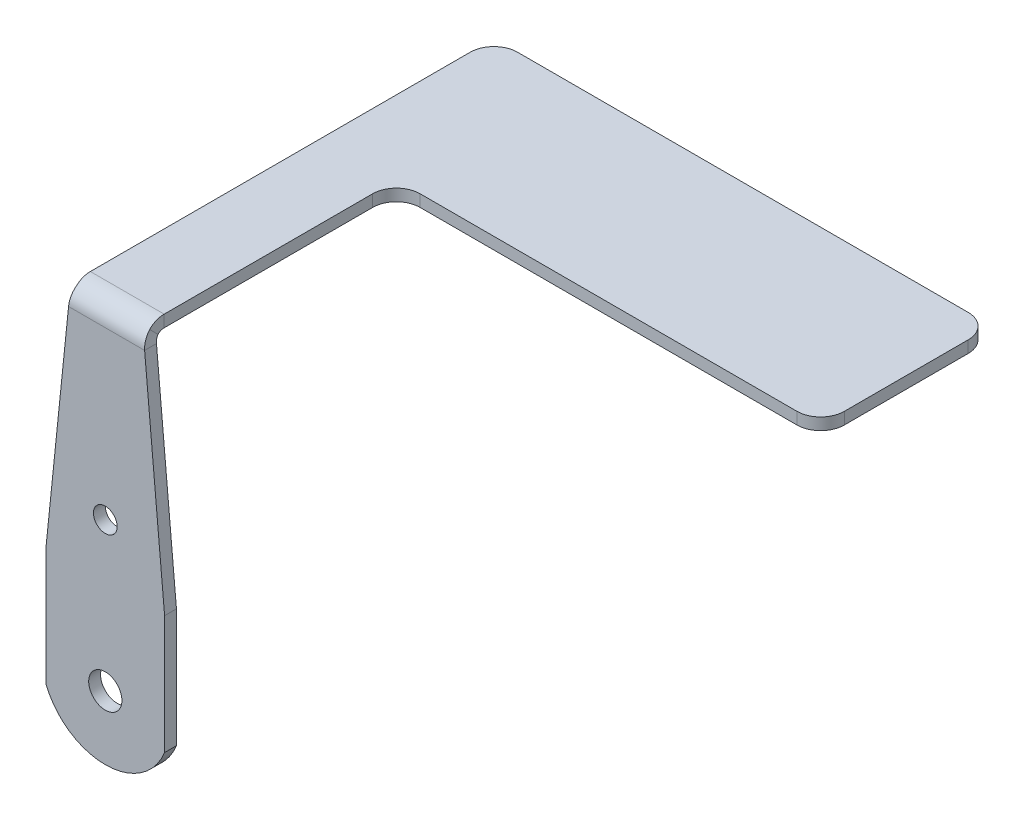
ISO-10303-21;
HEADER;
FILE_DESCRIPTION(('STEP AP214'),'2;1');
FILE_NAME('part.step','',(''),(''),'','','');
FILE_SCHEMA(('AUTOMOTIVE_DESIGN { 1 0 10303 214 1 1 1 1 }'));
ENDSEC;
DATA;
#1=APPLICATION_CONTEXT('core data for automotive mechanical design processes');
#2=APPLICATION_PROTOCOL_DEFINITION('international standard','automotive_design',2000,#1);
#3=PRODUCT_CONTEXT('',#1,'mechanical');
#4=PRODUCT('Part','Part','',(#3));
#5=PRODUCT_RELATED_PRODUCT_CATEGORY('part','',(#4));
#6=PRODUCT_DEFINITION_FORMATION('','',#4);
#7=PRODUCT_DEFINITION_CONTEXT('part definition',#1,'design');
#8=PRODUCT_DEFINITION('design','',#6,#7);
#9=PRODUCT_DEFINITION_SHAPE('','',#8);
#10=(LENGTH_UNIT() NAMED_UNIT(*) SI_UNIT(.MILLI.,.METRE.));
#11=(NAMED_UNIT(*) PLANE_ANGLE_UNIT() SI_UNIT($,.RADIAN.));
#12=(NAMED_UNIT(*) SI_UNIT($,.STERADIAN.) SOLID_ANGLE_UNIT());
#13=UNCERTAINTY_MEASURE_WITH_UNIT(LENGTH_MEASURE(1.E-05),#10,'distance_accuracy_value','');
#14=(GEOMETRIC_REPRESENTATION_CONTEXT(3) GLOBAL_UNCERTAINTY_ASSIGNED_CONTEXT((#13)) GLOBAL_UNIT_ASSIGNED_CONTEXT((#10,
#11,#12)) REPRESENTATION_CONTEXT('',''));
#15=CARTESIAN_POINT('',(0.,0.,0.));
#16=DIRECTION('',(0.,0.,1.));
#17=DIRECTION('',(1.,0.,0.));
#18=AXIS2_PLACEMENT_3D('',#15,#16,#17);
#19=CARTESIAN_POINT('',(42.1509861979315,13.5038150311188,-33.7652042118766));
#20=DIRECTION('',(-1.,0.,0.));
#21=DIRECTION('',(0.,1.,0.));
#22=AXIS2_PLACEMENT_3D('',#19,#20,#21);
#23=PLANE('',#22);
#24=DIRECTION('',(0.,0.,1.));
#25=VECTOR('',#24,1.);
#26=CARTESIAN_POINT('',(42.1509861979315,13.5038150311188,-33.7652042118766));
#27=LINE('',#26,#25);
#28=CARTESIAN_POINT('',(42.1509861979315,13.5038150311188,-33.7652042118766));
#29=VERTEX_POINT('',#28);
#30=CARTESIAN_POINT('',(42.1509861979315,13.5038150311189,-1.7366));
#31=VERTEX_POINT('',#30);
#32=EDGE_CURVE('E164',#29,#31,#27,.T.);
#33=ORIENTED_EDGE('',*,*,#32,.T.);
#34=DIRECTION('',(0.,1.,0.));
#35=VECTOR('',#34,1.);
#36=CARTESIAN_POINT('',(42.1509861979315,13.5038150311189,-1.7366));
#37=LINE('',#36,#35);
#38=CARTESIAN_POINT('',(42.1509861979315,14.5038150311189,-1.73660000000001));
#39=VERTEX_POINT('',#38);
#40=EDGE_CURVE('E12',#31,#39,#37,.T.);
#41=ORIENTED_EDGE('',*,*,#40,.T.);
#42=DIRECTION('',(0.,0.,1.));
#43=VECTOR('',#42,1.);
#44=CARTESIAN_POINT('',(42.1509861979315,14.5038150311188,-33.7652042118766));
#45=LINE('',#44,#43);
#46=CARTESIAN_POINT('',(42.1509861979315,14.5038150311188,-33.7652042118766));
#47=VERTEX_POINT('',#46);
#48=EDGE_CURVE('E191',#47,#39,#45,.T.);
#49=ORIENTED_EDGE('',*,*,#48,.F.);
#50=DIRECTION('',(0.,1.,0.));
#51=VECTOR('',#50,1.);
#52=CARTESIAN_POINT('',(42.1509861979315,13.5038150311188,-33.7652042118766));
#53=LINE('',#52,#51);
#54=EDGE_CURVE('E152',#29,#47,#53,.T.);
#55=ORIENTED_EDGE('',*,*,#54,.F.);
#56=EDGE_LOOP('',(#33,#41,#49,#55));
#57=FACE_BOUND('',#56,.T.);
#58=ADVANCED_FACE('F56',(#57),#23,.T.);
#59=CARTESIAN_POINT('',(48.375969085374,13.5038150311188,-19.3196620303949));
#60=DIRECTION('',(1.,0.,0.));
#61=DIRECTION('',(0.,-1.,0.));
#62=AXIS2_PLACEMENT_3D('',#59,#60,#61);
#63=PLANE('',#62);
#64=DIRECTION('',(0.,0.,-1.));
#65=VECTOR('',#64,1.);
#66=CARTESIAN_POINT('',(48.375969085374,14.5038150311188,-19.3196620303949));
#67=LINE('',#66,#65);
#68=CARTESIAN_POINT('',(48.375969085374,14.5038150311189,-1.73660000000001));
#69=VERTEX_POINT('',#68);
#70=CARTESIAN_POINT('',(48.375969085374,14.5038150311188,-19.3196620303949));
#71=VERTEX_POINT('',#70);
#72=EDGE_CURVE('E115',#69,#71,#67,.T.);
#73=ORIENTED_EDGE('',*,*,#72,.F.);
#74=DIRECTION('',(0.,-1.,0.));
#75=VECTOR('',#74,1.);
#76=CARTESIAN_POINT('',(48.375969085374,13.5038150311189,-1.7366));
#77=LINE('',#76,#75);
#78=CARTESIAN_POINT('',(48.375969085374,13.5038150311189,-1.7366));
#79=VERTEX_POINT('',#78);
#80=EDGE_CURVE('E205',#69,#79,#77,.T.);
#81=ORIENTED_EDGE('',*,*,#80,.T.);
#82=DIRECTION('',(0.,0.,-1.));
#83=VECTOR('',#82,1.);
#84=CARTESIAN_POINT('',(48.375969085374,13.5038150311188,-19.3196620303949));
#85=LINE('',#84,#83);
#86=CARTESIAN_POINT('',(48.375969085374,13.5038150311188,-19.3196620303949));
#87=VERTEX_POINT('',#86);
#88=EDGE_CURVE('E59',#79,#87,#85,.T.);
#89=ORIENTED_EDGE('',*,*,#88,.T.);
#90=DIRECTION('',(0.,1.,0.));
#91=VECTOR('',#90,1.);
#92=CARTESIAN_POINT('',(48.375969085374,13.5038150311188,-19.3196620303949));
#93=LINE('',#92,#91);
#94=EDGE_CURVE('E192',#87,#71,#93,.T.);
#95=ORIENTED_EDGE('',*,*,#94,.T.);
#96=EDGE_LOOP('',(#73,#81,#89,#95));
#97=FACE_BOUND('',#96,.T.);
#98=ADVANCED_FACE('F240',(#97),#63,.T.);
#99=CARTESIAN_POINT('',(50.375969085374,13.5038150311188,-19.3196620303949));
#100=DIRECTION('',(0.,-1.,0.));
#101=DIRECTION('',(-1.,0.,0.));
#102=AXIS2_PLACEMENT_3D('',#99,#100,#101);
#103=PLANE('',#102);
#104=ORIENTED_EDGE('',*,*,#88,.F.);
#105=DIRECTION('',(-1.,0.,0.));
#106=VECTOR('',#105,1.);
#107=CARTESIAN_POINT('',(50.375969085374,13.5038150311189,-1.7366));
#108=LINE('',#107,#106);
#109=EDGE_CURVE('E194',#79,#31,#108,.T.);
#110=ORIENTED_EDGE('',*,*,#109,.T.);
#111=ORIENTED_EDGE('',*,*,#32,.F.);
#112=CARTESIAN_POINT('',(44.1509861979315,13.5038150311188,-33.7652042118766));
#113=DIRECTION('',(0.,1.,0.));
#114=DIRECTION('',(-1.,0.,0.));
#115=AXIS2_PLACEMENT_3D('',#112,#113,#114);
#116=CIRCLE('',#115,2.);
#117=CARTESIAN_POINT('',(44.1509861979315,13.5038150311188,-35.7652042118766));
#118=VERTEX_POINT('',#117);
#119=EDGE_CURVE('E145',#118,#29,#116,.T.);
#120=ORIENTED_EDGE('',*,*,#119,.F.);
#121=DIRECTION('',(-1.,0.,0.));
#122=VECTOR('',#121,1.);
#123=CARTESIAN_POINT('',(44.1509861979315,13.5038150311188,-35.7652042118766));
#124=LINE('',#123,#122);
#125=CARTESIAN_POINT('',(82.1509861979315,13.5038150311187,-35.7652042118766));
#126=VERTEX_POINT('',#125);
#127=EDGE_CURVE('E160',#126,#118,#124,.T.);
#128=ORIENTED_EDGE('',*,*,#127,.F.);
#129=CARTESIAN_POINT('',(82.1509861979315,13.5038150311187,-33.7652042118766));
#130=DIRECTION('',(0.,1.,0.));
#131=DIRECTION('',(-1.,0.,0.));
#132=AXIS2_PLACEMENT_3D('',#129,#130,#131);
#133=CIRCLE('',#132,2.);
#134=CARTESIAN_POINT('',(84.1509861979315,13.5038150311187,-33.7652042118766));
#135=VERTEX_POINT('',#134);
#136=EDGE_CURVE('E167',#135,#126,#133,.T.);
#137=ORIENTED_EDGE('',*,*,#136,.F.);
#138=DIRECTION('',(0.,0.,-1.));
#139=VECTOR('',#138,1.);
#140=CARTESIAN_POINT('',(84.1509861979315,13.5038150311187,-33.7652042118766));
#141=LINE('',#140,#139);
#142=CARTESIAN_POINT('',(84.1509861979315,13.5038150311188,-23.3196620303949));
#143=VERTEX_POINT('',#142);
#144=EDGE_CURVE('E169',#143,#135,#141,.T.);
#145=ORIENTED_EDGE('',*,*,#144,.F.);
#146=CARTESIAN_POINT('',(82.1509861979315,13.5038150311188,-23.3196620303949));
#147=DIRECTION('',(0.,1.,0.));
#148=DIRECTION('',(1.,0.,0.));
#149=AXIS2_PLACEMENT_3D('',#146,#147,#148);
#150=CIRCLE('',#149,2.00000000000001);
#151=CARTESIAN_POINT('',(82.1509861979315,13.5038150311188,-21.3196620303949));
#152=VERTEX_POINT('',#151);
#153=EDGE_CURVE('E217',#152,#143,#150,.T.);
#154=ORIENTED_EDGE('',*,*,#153,.F.);
#155=DIRECTION('',(1.,0.,0.));
#156=VECTOR('',#155,1.);
#157=CARTESIAN_POINT('',(82.1509861979315,13.5038150311188,-21.3196620303949));
#158=LINE('',#157,#156);
#159=CARTESIAN_POINT('',(50.375969085374,13.5038150311188,-21.3196620303949));
#160=VERTEX_POINT('',#159);
#161=EDGE_CURVE('E213',#160,#152,#158,.T.);
#162=ORIENTED_EDGE('',*,*,#161,.F.);
#163=CARTESIAN_POINT('',(50.375969085374,13.5038150311188,-19.3196620303949));
#164=DIRECTION('',(0.,-1.,0.));
#165=DIRECTION('',(-1.,0.,0.));
#166=AXIS2_PLACEMENT_3D('',#163,#164,#165);
#167=CIRCLE('',#166,2.);
#168=EDGE_CURVE('E211',#87,#160,#167,.T.);
#169=ORIENTED_EDGE('',*,*,#168,.F.);
#170=EDGE_LOOP('',(#104,#110,#111,#120,#128,#137,#145,#154,#162,#169));
#171=FACE_BOUND('',#170,.T.);
#172=ADVANCED_FACE('F158',(#171),#103,.T.);
#173=CARTESIAN_POINT('',(50.375969085374,13.5038150311188,-19.3196620303949));
#174=DIRECTION('',(0.,1.,0.));
#175=DIRECTION('',(1.,0.,0.));
#176=AXIS2_PLACEMENT_3D('',#173,#174,#175);
#177=CYLINDRICAL_SURFACE('',#176,2.);
#178=CARTESIAN_POINT('',(50.375969085374,14.5038150311188,-19.3196620303949));
#179=DIRECTION('',(0.,-1.,0.));
#180=DIRECTION('',(-1.,0.,0.));
#181=AXIS2_PLACEMENT_3D('',#178,#179,#180);
#182=CIRCLE('',#181,2.);
#183=CARTESIAN_POINT('',(50.375969085374,14.5038150311188,-21.319662030395));
#184=VERTEX_POINT('',#183);
#185=EDGE_CURVE('E173',#71,#184,#182,.T.);
#186=ORIENTED_EDGE('',*,*,#185,.F.);
#187=ORIENTED_EDGE('',*,*,#94,.F.);
#188=ORIENTED_EDGE('',*,*,#168,.T.);
#189=DIRECTION('',(0.,1.,0.));
#190=VECTOR('',#189,1.);
#191=CARTESIAN_POINT('',(50.375969085374,13.5038150311188,-21.3196620303949));
#192=LINE('',#191,#190);
#193=EDGE_CURVE('E122',#160,#184,#192,.T.);
#194=ORIENTED_EDGE('',*,*,#193,.T.);
#195=EDGE_LOOP('',(#186,#187,#188,#194));
#196=FACE_BOUND('',#195,.T.);
#197=ADVANCED_FACE('F459',(#196),#177,.F.);
#198=CARTESIAN_POINT('',(44.1509861979315,13.5038150311188,-33.7652042118766));
#199=DIRECTION('',(0.,1.,0.));
#200=DIRECTION('',(1.,0.,0.));
#201=AXIS2_PLACEMENT_3D('',#198,#199,#200);
#202=CYLINDRICAL_SURFACE('',#201,2.);
#203=CARTESIAN_POINT('',(44.1509861979315,14.5038150311188,-33.7652042118766));
#204=DIRECTION('',(0.,1.,0.));
#205=DIRECTION('',(-1.,0.,0.));
#206=AXIS2_PLACEMENT_3D('',#203,#204,#205);
#207=CIRCLE('',#206,2.);
#208=CARTESIAN_POINT('',(44.1509861979315,14.5038150311188,-35.7652042118766));
#209=VERTEX_POINT('',#208);
#210=EDGE_CURVE('E147',#209,#47,#207,.T.);
#211=ORIENTED_EDGE('',*,*,#210,.F.);
#212=DIRECTION('',(0.,1.,0.));
#213=VECTOR('',#212,1.);
#214=CARTESIAN_POINT('',(44.1509861979315,13.5038150311188,-35.7652042118766));
#215=LINE('',#214,#213);
#216=EDGE_CURVE('E142',#118,#209,#215,.T.);
#217=ORIENTED_EDGE('',*,*,#216,.F.);
#218=ORIENTED_EDGE('',*,*,#119,.T.);
#219=ORIENTED_EDGE('',*,*,#54,.T.);
#220=EDGE_LOOP('',(#211,#217,#218,#219));
#221=FACE_BOUND('',#220,.T.);
#222=ADVANCED_FACE('F144',(#221),#202,.T.);
#223=CARTESIAN_POINT('',(44.1509861979315,13.5038150311188,-35.7652042118766));
#224=DIRECTION('',(0.,0.,-1.));
#225=DIRECTION('',(0.,1.,0.));
#226=AXIS2_PLACEMENT_3D('',#223,#224,#225);
#227=PLANE('',#226);
#228=DIRECTION('',(-1.,0.,0.));
#229=VECTOR('',#228,1.);
#230=CARTESIAN_POINT('',(44.1509861979315,14.5038150311188,-35.7652042118766));
#231=LINE('',#230,#229);
#232=CARTESIAN_POINT('',(82.1509861979315,14.5038150311187,-35.7652042118766));
#233=VERTEX_POINT('',#232);
#234=EDGE_CURVE('E188',#233,#209,#231,.T.);
#235=ORIENTED_EDGE('',*,*,#234,.F.);
#236=DIRECTION('',(0.,1.,0.));
#237=VECTOR('',#236,1.);
#238=CARTESIAN_POINT('',(82.1509861979315,13.5038150311187,-35.7652042118766));
#239=LINE('',#238,#237);
#240=EDGE_CURVE('E153',#126,#233,#239,.T.);
#241=ORIENTED_EDGE('',*,*,#240,.F.);
#242=ORIENTED_EDGE('',*,*,#127,.T.);
#243=ORIENTED_EDGE('',*,*,#216,.T.);
#244=EDGE_LOOP('',(#235,#241,#242,#243));
#245=FACE_BOUND('',#244,.T.);
#246=ADVANCED_FACE('F166',(#245),#227,.T.);
#247=CARTESIAN_POINT('',(82.1509861979315,13.5038150311187,-33.7652042118766));
#248=DIRECTION('',(0.,1.,0.));
#249=DIRECTION('',(1.,0.,0.));
#250=AXIS2_PLACEMENT_3D('',#247,#248,#249);
#251=CYLINDRICAL_SURFACE('',#250,2.);
#252=CARTESIAN_POINT('',(82.1509861979315,14.5038150311187,-33.7652042118766));
#253=DIRECTION('',(0.,1.,0.));
#254=DIRECTION('',(-1.,0.,0.));
#255=AXIS2_PLACEMENT_3D('',#252,#253,#254);
#256=CIRCLE('',#255,2.);
#257=CARTESIAN_POINT('',(84.1509861979315,14.5038150311187,-33.7652042118766));
#258=VERTEX_POINT('',#257);
#259=EDGE_CURVE('E185',#258,#233,#256,.T.);
#260=ORIENTED_EDGE('',*,*,#259,.F.);
#261=DIRECTION('',(0.,1.,0.));
#262=VECTOR('',#261,1.);
#263=CARTESIAN_POINT('',(84.1509861979315,13.5038150311187,-33.7652042118766));
#264=LINE('',#263,#262);
#265=EDGE_CURVE('E197',#135,#258,#264,.T.);
#266=ORIENTED_EDGE('',*,*,#265,.F.);
#267=ORIENTED_EDGE('',*,*,#136,.T.);
#268=ORIENTED_EDGE('',*,*,#240,.T.);
#269=EDGE_LOOP('',(#260,#266,#267,#268));
#270=FACE_BOUND('',#269,.T.);
#271=ADVANCED_FACE('F462',(#270),#251,.T.);
#272=CARTESIAN_POINT('',(84.1509861979315,13.5038150311187,-33.7652042118766));
#273=DIRECTION('',(1.,0.,0.));
#274=DIRECTION('',(0.,0.,-1.));
#275=AXIS2_PLACEMENT_3D('',#272,#273,#274);
#276=PLANE('',#275);
#277=DIRECTION('',(0.,0.,-1.));
#278=VECTOR('',#277,1.);
#279=CARTESIAN_POINT('',(84.1509861979315,14.5038150311187,-33.7652042118766));
#280=LINE('',#279,#278);
#281=CARTESIAN_POINT('',(84.1509861979315,14.5038150311188,-23.319662030395));
#282=VERTEX_POINT('',#281);
#283=EDGE_CURVE('E182',#282,#258,#280,.T.);
#284=ORIENTED_EDGE('',*,*,#283,.F.);
#285=DIRECTION('',(0.,1.,0.));
#286=VECTOR('',#285,1.);
#287=CARTESIAN_POINT('',(84.1509861979315,13.5038150311188,-23.3196620303949));
#288=LINE('',#287,#286);
#289=EDGE_CURVE('E199',#143,#282,#288,.T.);
#290=ORIENTED_EDGE('',*,*,#289,.F.);
#291=ORIENTED_EDGE('',*,*,#144,.T.);
#292=ORIENTED_EDGE('',*,*,#265,.T.);
#293=EDGE_LOOP('',(#284,#290,#291,#292));
#294=FACE_BOUND('',#293,.T.);
#295=ADVANCED_FACE('F228',(#294),#276,.T.);
#296=CARTESIAN_POINT('',(82.1509861979315,13.5038150311188,-23.3196620303949));
#297=DIRECTION('',(0.,1.,0.));
#298=DIRECTION('',(1.,0.,0.));
#299=AXIS2_PLACEMENT_3D('',#296,#297,#298);
#300=CYLINDRICAL_SURFACE('',#299,2.00000000000001);
#301=CARTESIAN_POINT('',(82.1509861979315,14.5038150311188,-23.319662030395));
#302=DIRECTION('',(0.,1.,0.));
#303=DIRECTION('',(1.,0.,0.));
#304=AXIS2_PLACEMENT_3D('',#301,#302,#303);
#305=CIRCLE('',#304,2.00000000000001);
#306=CARTESIAN_POINT('',(82.1509861979315,14.5038150311188,-21.3196620303949));
#307=VERTEX_POINT('',#306);
#308=EDGE_CURVE('E179',#307,#282,#305,.T.);
#309=ORIENTED_EDGE('',*,*,#308,.F.);
#310=DIRECTION('',(0.,1.,0.));
#311=VECTOR('',#310,1.);
#312=CARTESIAN_POINT('',(82.1509861979315,13.5038150311188,-21.3196620303949));
#313=LINE('',#312,#311);
#314=EDGE_CURVE('E201',#152,#307,#313,.T.);
#315=ORIENTED_EDGE('',*,*,#314,.F.);
#316=ORIENTED_EDGE('',*,*,#153,.T.);
#317=ORIENTED_EDGE('',*,*,#289,.T.);
#318=EDGE_LOOP('',(#309,#315,#316,#317));
#319=FACE_BOUND('',#318,.T.);
#320=ADVANCED_FACE('F233',(#319),#300,.T.);
#321=CARTESIAN_POINT('',(82.1509861979315,13.5038150311188,-21.3196620303949));
#322=DIRECTION('',(0.,0.,1.));
#323=DIRECTION('',(1.,0.,0.));
#324=AXIS2_PLACEMENT_3D('',#321,#322,#323);
#325=PLANE('',#324);
#326=DIRECTION('',(1.,0.,0.));
#327=VECTOR('',#326,1.);
#328=CARTESIAN_POINT('',(82.1509861979315,14.5038150311188,-21.319662030395));
#329=LINE('',#328,#327);
#330=EDGE_CURVE('E175',#184,#307,#329,.T.);
#331=ORIENTED_EDGE('',*,*,#330,.F.);
#332=ORIENTED_EDGE('',*,*,#193,.F.);
#333=ORIENTED_EDGE('',*,*,#161,.T.);
#334=ORIENTED_EDGE('',*,*,#314,.T.);
#335=EDGE_LOOP('',(#331,#332,#333,#334));
#336=FACE_BOUND('',#335,.T.);
#337=ADVANCED_FACE('F234',(#336),#325,.T.);
#338=CARTESIAN_POINT('',(50.375969085374,14.5038150311188,-19.3196620303949));
#339=DIRECTION('',(0.,-1.,0.));
#340=DIRECTION('',(-1.,0.,0.));
#341=AXIS2_PLACEMENT_3D('',#338,#339,#340);
#342=PLANE('',#341);
#343=DIRECTION('',(-1.,0.,0.));
#344=VECTOR('',#343,1.);
#345=CARTESIAN_POINT('',(50.375969085374,14.5038150311189,-1.73660000000001));
#346=LINE('',#345,#344);
#347=EDGE_CURVE('E64',#69,#39,#346,.T.);
#348=ORIENTED_EDGE('',*,*,#347,.F.);
#349=ORIENTED_EDGE('',*,*,#72,.T.);
#350=ORIENTED_EDGE('',*,*,#185,.T.);
#351=ORIENTED_EDGE('',*,*,#330,.T.);
#352=ORIENTED_EDGE('',*,*,#308,.T.);
#353=ORIENTED_EDGE('',*,*,#283,.T.);
#354=ORIENTED_EDGE('',*,*,#259,.T.);
#355=ORIENTED_EDGE('',*,*,#234,.T.);
#356=ORIENTED_EDGE('',*,*,#210,.T.);
#357=ORIENTED_EDGE('',*,*,#48,.T.);
#358=EDGE_LOOP('',(#348,#349,#350,#351,#352,#353,#354,#355,#356,#357));
#359=FACE_BOUND('',#358,.T.);
#360=ADVANCED_FACE('F380',(#359),#342,.F.);
#361=CARTESIAN_POINT('',(45.1482089892891,-13.7615616000238,-1.));
#362=DIRECTION('',(0.,0.,1.));
#363=DIRECTION('',(1.,0.,0.));
#364=AXIS2_PLACEMENT_3D('',#361,#362,#363);
#365=CYLINDRICAL_SURFACE('',#364,1.3999999999584);
#366=CARTESIAN_POINT('',(45.1482089892891,-13.7615616000238,-1.));
#367=DIRECTION('',(0.,0.,1.));
#368=DIRECTION('',(1.,0.,0.));
#369=AXIS2_PLACEMENT_3D('',#366,#367,#368);
#370=CIRCLE('',#369,1.3999999999584);
#371=CARTESIAN_POINT('',(46.5482089892475,-13.7615616000238,-1.));
#372=VERTEX_POINT('',#371);
#373=EDGE_CURVE('E528',#372,#372,#370,.T.);
#374=ORIENTED_EDGE('',*,*,#373,.F.);
#375=EDGE_LOOP('',(#374));
#376=FACE_BOUND('',#375,.T.);
#377=CARTESIAN_POINT('',(45.1482089892891,-13.7615616000238,0.));
#378=DIRECTION('',(0.,0.,1.));
#379=DIRECTION('',(1.,0.,0.));
#380=AXIS2_PLACEMENT_3D('',#377,#378,#379);
#381=CIRCLE('',#380,1.3999999999584);
#382=CARTESIAN_POINT('',(46.5482089892475,-13.7615616000238,0.));
#383=VERTEX_POINT('',#382);
#384=EDGE_CURVE('E533',#383,#383,#381,.T.);
#385=ORIENTED_EDGE('',*,*,#384,.T.);
#386=EDGE_LOOP('',(#385));
#387=FACE_BOUND('',#386,.T.);
#388=ADVANCED_FACE('F376',(#376,#387),#365,.F.);
#389=CARTESIAN_POINT('',(45.1482089892891,-1.26156160002384,-1.));
#390=DIRECTION('',(0.,0.,1.));
#391=DIRECTION('',(1.,0.,0.));
#392=AXIS2_PLACEMENT_3D('',#389,#390,#391);
#393=CYLINDRICAL_SURFACE('',#392,0.9999999999584);
#394=CARTESIAN_POINT('',(45.1482089892891,-1.26156160002384,-1.));
#395=DIRECTION('',(0.,0.,1.));
#396=DIRECTION('',(1.,0.,0.));
#397=AXIS2_PLACEMENT_3D('',#394,#395,#396);
#398=CIRCLE('',#397,0.9999999999584);
#399=CARTESIAN_POINT('',(46.1482089892475,-1.26156160002384,-1.));
#400=VERTEX_POINT('',#399);
#401=EDGE_CURVE('E815',#400,#400,#398,.T.);
#402=ORIENTED_EDGE('',*,*,#401,.F.);
#403=EDGE_LOOP('',(#402));
#404=FACE_BOUND('',#403,.T.);
#405=CARTESIAN_POINT('',(45.1482089892891,-1.26156160002384,0.));
#406=DIRECTION('',(0.,0.,1.));
#407=DIRECTION('',(1.,0.,0.));
#408=AXIS2_PLACEMENT_3D('',#405,#406,#407);
#409=CIRCLE('',#408,0.9999999999584);
#410=CARTESIAN_POINT('',(46.1482089892475,-1.26156160002384,0.));
#411=VERTEX_POINT('',#410);
#412=EDGE_CURVE('E799',#411,#411,#409,.T.);
#413=ORIENTED_EDGE('',*,*,#412,.T.);
#414=EDGE_LOOP('',(#413));
#415=FACE_BOUND('',#414,.T.);
#416=ADVANCED_FACE('F379',(#404,#415),#393,.F.);
#417=CARTESIAN_POINT('',(40.1482089892891,-5.76156160002383,-1.));
#418=DIRECTION('',(-1.,0.,0.));
#419=DIRECTION('',(0.,0.,1.));
#420=AXIS2_PLACEMENT_3D('',#417,#418,#419);
#421=PLANE('',#420);
#422=DIRECTION('',(0.,-1.,0.));
#423=VECTOR('',#422,1.);
#424=CARTESIAN_POINT('',(40.1482089892891,-5.76156160002383,0.));
#425=LINE('',#424,#423);
#426=CARTESIAN_POINT('',(40.1482089892891,-5.76156160002383,0.));
#427=VERTEX_POINT('',#426);
#428=CARTESIAN_POINT('',(40.1482089892891,-15.7615616000238,0.));
#429=VERTEX_POINT('',#428);
#430=EDGE_CURVE('E434',#427,#429,#425,.T.);
#431=ORIENTED_EDGE('',*,*,#430,.F.);
#432=DIRECTION('',(0.,0.,1.));
#433=VECTOR('',#432,1.);
#434=CARTESIAN_POINT('',(40.1482089892891,-5.76156160002383,-1.));
#435=LINE('',#434,#433);
#436=CARTESIAN_POINT('',(40.1482089892891,-5.76156160002383,-1.));
#437=VERTEX_POINT('',#436);
#438=EDGE_CURVE('E176',#437,#427,#435,.T.);
#439=ORIENTED_EDGE('',*,*,#438,.F.);
#440=DIRECTION('',(0.,-1.,0.));
#441=VECTOR('',#440,1.);
#442=CARTESIAN_POINT('',(40.1482089892891,-5.76156160002383,-1.));
#443=LINE('',#442,#441);
#444=CARTESIAN_POINT('',(40.1482089892891,-15.7615616000238,-1.));
#445=VERTEX_POINT('',#444);
#446=EDGE_CURVE('E828',#437,#445,#443,.T.);
#447=ORIENTED_EDGE('',*,*,#446,.T.);
#448=DIRECTION('',(0.,0.,1.));
#449=VECTOR('',#448,1.);
#450=CARTESIAN_POINT('',(40.1482089892891,-15.7615616000238,-1.));
#451=LINE('',#450,#449);
#452=EDGE_CURVE('E826',#445,#429,#451,.T.);
#453=ORIENTED_EDGE('',*,*,#452,.T.);
#454=EDGE_LOOP('',(#431,#439,#447,#453));
#455=FACE_BOUND('',#454,.T.);
#456=ADVANCED_FACE('F384',(#455),#421,.T.);
#457=CARTESIAN_POINT('',(45.1482089892891,-13.7615616000238,-1.));
#458=DIRECTION('',(0.,0.,1.));
#459=DIRECTION('',(1.,0.,0.));
#460=AXIS2_PLACEMENT_3D('',#457,#458,#459);
#461=CYLINDRICAL_SURFACE('',#460,5.3851648071345);
#462=CARTESIAN_POINT('',(45.1482089892891,-13.7615616000238,0.));
#463=DIRECTION('',(0.,0.,1.));
#464=DIRECTION('',(1.,0.,0.));
#465=AXIS2_PLACEMENT_3D('',#462,#463,#464);
#466=CIRCLE('',#465,5.3851648071345);
#467=CARTESIAN_POINT('',(50.1482089892891,-15.7615616000238,0.));
#468=VERTEX_POINT('',#467);
#469=EDGE_CURVE('E809',#429,#468,#466,.T.);
#470=ORIENTED_EDGE('',*,*,#469,.F.);
#471=ORIENTED_EDGE('',*,*,#452,.F.);
#472=CARTESIAN_POINT('',(45.1482089892891,-13.7615616000238,-1.));
#473=DIRECTION('',(0.,0.,1.));
#474=DIRECTION('',(1.,0.,0.));
#475=AXIS2_PLACEMENT_3D('',#472,#473,#474);
#476=CIRCLE('',#475,5.3851648071345);
#477=CARTESIAN_POINT('',(50.1482089892891,-15.7615616000238,-1.));
#478=VERTEX_POINT('',#477);
#479=EDGE_CURVE('E823',#445,#478,#476,.T.);
#480=ORIENTED_EDGE('',*,*,#479,.T.);
#481=DIRECTION('',(0.,0.,1.));
#482=VECTOR('',#481,1.);
#483=CARTESIAN_POINT('',(50.1482089892891,-15.7615616000238,-1.));
#484=LINE('',#483,#482);
#485=EDGE_CURVE('E821',#478,#468,#484,.T.);
#486=ORIENTED_EDGE('',*,*,#485,.T.);
#487=EDGE_LOOP('',(#470,#471,#480,#486));
#488=FACE_BOUND('',#487,.T.);
#489=ADVANCED_FACE('F388',(#488),#461,.T.);
#490=CARTESIAN_POINT('',(50.1482089892891,-5.76156160002383,-1.));
#491=DIRECTION('',(1.,0.,0.));
#492=DIRECTION('',(0.,0.,-1.));
#493=AXIS2_PLACEMENT_3D('',#490,#491,#492);
#494=PLANE('',#493);
#495=DIRECTION('',(0.,1.,0.));
#496=VECTOR('',#495,1.);
#497=CARTESIAN_POINT('',(50.1482089892891,-5.76156160002383,0.));
#498=LINE('',#497,#496);
#499=CARTESIAN_POINT('',(50.1482089892891,-5.76156160002383,0.));
#500=VERTEX_POINT('',#499);
#501=EDGE_CURVE('E806',#468,#500,#498,.T.);
#502=ORIENTED_EDGE('',*,*,#501,.F.);
#503=ORIENTED_EDGE('',*,*,#485,.F.);
#504=DIRECTION('',(0.,1.,0.));
#505=VECTOR('',#504,1.);
#506=CARTESIAN_POINT('',(50.1482089892891,-5.76156160002383,-1.));
#507=LINE('',#506,#505);
#508=CARTESIAN_POINT('',(50.1482089892891,-5.76156160002383,-1.));
#509=VERTEX_POINT('',#508);
#510=EDGE_CURVE('E819',#478,#509,#507,.T.);
#511=ORIENTED_EDGE('',*,*,#510,.T.);
#512=DIRECTION('',(0.,0.,1.));
#513=VECTOR('',#512,1.);
#514=CARTESIAN_POINT('',(50.1482089892891,-5.76156160002383,-1.));
#515=LINE('',#514,#513);
#516=EDGE_CURVE('E525',#509,#500,#515,.T.);
#517=ORIENTED_EDGE('',*,*,#516,.T.);
#518=EDGE_LOOP('',(#502,#503,#511,#517));
#519=FACE_BOUND('',#518,.T.);
#520=ADVANCED_FACE('F392',(#519),#494,.T.);
#521=CARTESIAN_POINT('',(50.375969085374,32.2927237992284,-1.));
#522=DIRECTION('',(0.,0.,-1.));
#523=DIRECTION('',(-1.,0.,0.));
#524=AXIS2_PLACEMENT_3D('',#521,#522,#523);
#525=PLANE('',#524);
#526=DIRECTION('',(-1.,0.,0.));
#527=VECTOR('',#526,1.);
#528=CARTESIAN_POINT('',(50.375969085374,12.7672150311189,-1.));
#529=LINE('',#528,#527);
#530=CARTESIAN_POINT('',(48.4642378448563,12.7672150311189,-1.));
#531=VERTEX_POINT('',#530);
#532=CARTESIAN_POINT('',(42.0512352221547,12.7672150311189,-1.));
#533=VERTEX_POINT('',#532);
#534=EDGE_CURVE('E530',#531,#533,#529,.T.);
#535=ORIENTED_EDGE('',*,*,#534,.F.);
#536=DIRECTION('',(-0.0905110593504262,0.995895450403939,0.));
#537=VECTOR('',#536,1.);
#538=CARTESIAN_POINT('',(50.1482089892891,-5.76156160002383,-1.));
#539=LINE('',#538,#537);
#540=EDGE_CURVE('E429',#509,#531,#539,.T.);
#541=ORIENTED_EDGE('',*,*,#540,.F.);
#542=ORIENTED_EDGE('',*,*,#510,.F.);
#543=ORIENTED_EDGE('',*,*,#479,.F.);
#544=ORIENTED_EDGE('',*,*,#446,.F.);
#545=DIRECTION('',(-0.102169065331331,-0.994767049157401,0.));
#546=VECTOR('',#545,1.);
#547=CARTESIAN_POINT('',(40.1482089892891,-5.76156160002383,-1.));
#548=LINE('',#547,#546);
#549=EDGE_CURVE('E447',#533,#437,#548,.T.);
#550=ORIENTED_EDGE('',*,*,#549,.F.);
#551=EDGE_LOOP('',(#535,#541,#542,#543,#544,#550));
#552=FACE_BOUND('',#551,.T.);
#553=ORIENTED_EDGE('',*,*,#401,.T.);
#554=EDGE_LOOP('',(#553));
#555=FACE_BOUND('',#554,.T.);
#556=ORIENTED_EDGE('',*,*,#373,.T.);
#557=EDGE_LOOP('',(#556));
#558=FACE_BOUND('',#557,.T.);
#559=ADVANCED_FACE('F396',(#552,#555,#558),#525,.T.);
#560=CARTESIAN_POINT('',(50.1482089892891,-5.76156160002383,-1.));
#561=DIRECTION('',(0.995895450403939,0.0905110593504262,0.));
#562=DIRECTION('',(-0.0905110593504262,0.995895450403939,0.));
#563=AXIS2_PLACEMENT_3D('',#560,#561,#562);
#564=PLANE('',#563);
#565=CARTESIAN_POINT('',(48.4642378448563,12.7672150311189,0.));
#566=CARTESIAN_POINT('',(48.4642378448563,12.7672150311189,-1.));
#567=B_SPLINE_CURVE_WITH_KNOTS('',1,(#565,#566),.UNSPECIFIED.,.F.,.F.,(2,2),(0.,1.),.UNSPECIFIED.);
#568=CARTESIAN_POINT('',(48.4642378448563,12.7672150311189,0.));
#569=VERTEX_POINT('',#568);
#570=EDGE_CURVE('E524',#569,#531,#567,.T.);
#571=ORIENTED_EDGE('',*,*,#570,.F.);
#572=DIRECTION('',(-0.0905110593504262,0.995895450403939,0.));
#573=VECTOR('',#572,1.);
#574=CARTESIAN_POINT('',(50.1482089892891,-5.76156160002383,0.));
#575=LINE('',#574,#573);
#576=EDGE_CURVE('E424',#500,#569,#575,.T.);
#577=ORIENTED_EDGE('',*,*,#576,.F.);
#578=ORIENTED_EDGE('',*,*,#516,.F.);
#579=ORIENTED_EDGE('',*,*,#540,.T.);
#580=EDGE_LOOP('',(#571,#577,#578,#579));
#581=FACE_BOUND('',#580,.T.);
#582=ADVANCED_FACE('F400',(#581),#564,.T.);
#583=CARTESIAN_POINT('',(50.375969085374,32.2927237992284,0.));
#584=DIRECTION('',(0.,0.,-1.));
#585=DIRECTION('',(-1.,0.,0.));
#586=AXIS2_PLACEMENT_3D('',#583,#584,#585);
#587=PLANE('',#586);
#588=ORIENTED_EDGE('',*,*,#412,.F.);
#589=EDGE_LOOP('',(#588));
#590=FACE_BOUND('',#589,.T.);
#591=ORIENTED_EDGE('',*,*,#384,.F.);
#592=EDGE_LOOP('',(#591));
#593=FACE_BOUND('',#592,.T.);
#594=ORIENTED_EDGE('',*,*,#576,.T.);
#595=DIRECTION('',(-1.,0.,0.));
#596=VECTOR('',#595,1.);
#597=CARTESIAN_POINT('',(50.375969085374,12.7672150311189,0.));
#598=LINE('',#597,#596);
#599=CARTESIAN_POINT('',(42.0512352221547,12.7672150311189,0.));
#600=VERTEX_POINT('',#599);
#601=EDGE_CURVE('E415',#569,#600,#598,.T.);
#602=ORIENTED_EDGE('',*,*,#601,.T.);
#603=DIRECTION('',(-0.102169065331331,-0.994767049157401,0.));
#604=VECTOR('',#603,1.);
#605=CARTESIAN_POINT('',(40.1482089892891,-5.76156160002383,0.));
#606=LINE('',#605,#604);
#607=EDGE_CURVE('E423',#600,#427,#606,.T.);
#608=ORIENTED_EDGE('',*,*,#607,.T.);
#609=ORIENTED_EDGE('',*,*,#430,.T.);
#610=ORIENTED_EDGE('',*,*,#469,.T.);
#611=ORIENTED_EDGE('',*,*,#501,.T.);
#612=EDGE_LOOP('',(#594,#602,#608,#609,#610,#611));
#613=FACE_BOUND('',#612,.T.);
#614=ADVANCED_FACE('F405',(#590,#593,#613),#587,.F.);
#615=CARTESIAN_POINT('',(40.1482089892891,-5.76156160002383,-1.));
#616=DIRECTION('',(-0.994767049157401,0.102169065331331,0.));
#617=DIRECTION('',(-0.102169065331331,-0.994767049157401,0.));
#618=AXIS2_PLACEMENT_3D('',#615,#616,#617);
#619=PLANE('',#618);
#620=CARTESIAN_POINT('',(42.0512352221547,12.7672150311189,-1.));
#621=CARTESIAN_POINT('',(42.0512352221547,12.7672150311189,0.));
#622=B_SPLINE_CURVE_WITH_KNOTS('',1,(#620,#621),.UNSPECIFIED.,.F.,.F.,(2,2),(0.,1.),.UNSPECIFIED.);
#623=EDGE_CURVE('E443',#533,#600,#622,.T.);
#624=ORIENTED_EDGE('',*,*,#623,.F.);
#625=ORIENTED_EDGE('',*,*,#549,.T.);
#626=ORIENTED_EDGE('',*,*,#438,.T.);
#627=ORIENTED_EDGE('',*,*,#607,.F.);
#628=EDGE_LOOP('',(#624,#625,#626,#627));
#629=FACE_BOUND('',#628,.T.);
#630=ADVANCED_FACE('F448',(#629),#619,.T.);
#631=CARTESIAN_POINT('',(48.375969085374,12.7672150311189,-1.7366));
#632=DIRECTION('',(-1.,0.,0.));
#633=DIRECTION('',(0.,0.,1.));
#634=AXIS2_PLACEMENT_3D('',#631,#632,#633);
#635=PLANE('',#634);
#636=ORIENTED_EDGE('',*,*,#80,.F.);
#637=CARTESIAN_POINT('',(48.375969085374,12.7672150311189,-1.7366));
#638=DIRECTION('',(1.,0.,0.));
#639=DIRECTION('',(0.,1.,0.));
#640=AXIS2_PLACEMENT_3D('',#637,#638,#639);
#641=CIRCLE('',#640,1.7366);
#642=CARTESIAN_POINT('',(48.375969085374,13.9951766673274,-0.508638363791446));
#643=VERTEX_POINT('',#642);
#644=EDGE_CURVE('E249',#69,#643,#641,.T.);
#645=ORIENTED_EDGE('',*,*,#644,.T.);
#646=CARTESIAN_POINT('',(48.375969085374,13.2880698861409,-1.21574514497799));
#647=CARTESIAN_POINT('',(48.375969085374,13.9951766673274,-0.508638363791444));
#648=B_SPLINE_CURVE_WITH_KNOTS('',1,(#646,#647),.UNSPECIFIED.,.F.,.F.,(2,2),(0.,1.),.UNSPECIFIED.);
#649=CARTESIAN_POINT('',(48.375969085374,13.2880698861409,-1.21574514497799));
#650=VERTEX_POINT('',#649);
#651=EDGE_CURVE('E327',#643,#650,#648,.F.);
#652=ORIENTED_EDGE('',*,*,#651,.T.);
#653=CARTESIAN_POINT('',(48.375969085374,12.7672150311189,-1.7366));
#654=DIRECTION('',(1.,0.,0.));
#655=DIRECTION('',(0.,0.,1.));
#656=AXIS2_PLACEMENT_3D('',#653,#654,#655);
#657=CIRCLE('',#656,0.736599999999999);
#658=EDGE_CURVE('E251',#79,#650,#657,.T.);
#659=ORIENTED_EDGE('',*,*,#658,.F.);
#660=EDGE_LOOP('',(#636,#645,#652,#659));
#661=FACE_BOUND('',#660,.T.);
#662=ADVANCED_FACE('F246',(#661),#635,.F.);
#663=CARTESIAN_POINT('',(48.375969085374,13.9951766673274,-0.508638363791444));
#664=CARTESIAN_POINT('',(48.3906831866611,13.8344080049524,-0.34786970141645));
#665=CARTESIAN_POINT('',(48.4053920052014,13.641799752431,-0.219182557983996));
#666=CARTESIAN_POINT('',(48.4348149250288,13.2217664070972,-0.0451990496978025));
#667=CARTESIAN_POINT('',(48.4495237435692,12.9945762538542,0.));
#668=CARTESIAN_POINT('',(48.4642378448563,12.7672150311189,0.));
#669=CARTESIAN_POINT('',(48.375969085374,13.2880698861409,-1.21574514497799));
#670=CARTESIAN_POINT('',(48.3906831373816,13.2198781320848,-1.14755339092191));
#671=CARTESIAN_POINT('',(48.4053920052014,13.1381807720601,-1.09296894633825));
#672=CARTESIAN_POINT('',(48.4348149250288,12.9600185227379,-1.01917172636612));
#673=CARTESIAN_POINT('',(48.4495237928486,12.863652734547,-1.));
#674=CARTESIAN_POINT('',(48.4642378448563,12.7672150311189,-1.));
#675=B_SPLINE_SURFACE_WITH_KNOTS('',1,3,((#663,#664,#665,#666,#667,#668),(#669,#670,#671,#672,
#673,#674)),.UNSPECIFIED.,.F.,.F.,.F.,(2,2),(4,2,4),(0.,1.),(0.,0.5,1.),.UNSPECIFIED.);
#676=CARTESIAN_POINT('',(48.375969085374,13.9951766673274,-0.508638363791444));
#677=CARTESIAN_POINT('',(48.3906831866611,13.8344080049524,-0.34786970141645));
#678=CARTESIAN_POINT('',(48.4053920052014,13.641799752431,-0.219182557983996));
#679=CARTESIAN_POINT('',(48.4348149250288,13.2217664070972,-0.0451990496978025));
#680=CARTESIAN_POINT('',(48.4495237435692,12.9945762538542,0.));
#681=CARTESIAN_POINT('',(48.4642378448563,12.7672150311189,0.));
#682=B_SPLINE_CURVE_WITH_KNOTS('',3,(#676,#677,#678,#679,#680,#681),.UNSPECIFIED.,.F.,.F.,(4,2,
4),(0.,0.5,1.),.UNSPECIFIED.);
#683=EDGE_CURVE('E262',#643,#569,#682,.T.);
#684=CARTESIAN_POINT('',(48.4642378448563,12.7672150311189,-1.));
#685=CARTESIAN_POINT('',(48.4495237928486,12.863652734547,-1.));
#686=CARTESIAN_POINT('',(48.4348149250288,12.9600185227379,-1.01917172636612));
#687=CARTESIAN_POINT('',(48.4053920052014,13.1381807720601,-1.09296894633825));
#688=CARTESIAN_POINT('',(48.3906831373816,13.2198781320848,-1.14755339092191));
#689=CARTESIAN_POINT('',(48.375969085374,13.2880698861409,-1.21574514497799));
#690=B_SPLINE_CURVE_WITH_KNOTS('',3,(#684,#685,#686,#687,#688,#689),.UNSPECIFIED.,.F.,.F.,(4,2,
4),(0.,0.5,1.),.UNSPECIFIED.);
#691=EDGE_CURVE('E279',#650,#531,#690,.F.);
#692=ORIENTED_EDGE('',*,*,#651,.F.);
#693=ORIENTED_EDGE('',*,*,#683,.T.);
#694=ORIENTED_EDGE('',*,*,#570,.T.);
#695=ORIENTED_EDGE('',*,*,#691,.F.);
#696=EDGE_LOOP('',(#692,#693,#694,#695));
#697=FACE_BOUND('',#696,.T.);
#698=ADVANCED_FACE('F285',(#697),#675,.F.);
#699=CARTESIAN_POINT('',(42.0512352221547,12.7672150311189,0.));
#700=CARTESIAN_POINT('',(42.0678633663082,12.9945762067407,0.));
#701=CARTESIAN_POINT('',(42.0844855474136,13.2217664070972,-0.0451990496978026));
#702=CARTESIAN_POINT('',(42.1177358726726,13.641799752431,-0.219182557983996));
#703=CARTESIAN_POINT('',(42.134358053778,13.8344080382667,-0.347869734730732));
#704=CARTESIAN_POINT('',(42.1509861979315,13.9951766673274,-0.508638363791445));
#705=CARTESIAN_POINT('',(42.0512352221547,12.7672150311189,-1.));
#706=CARTESIAN_POINT('',(42.0678632957145,12.8636526281258,-1.));
#707=CARTESIAN_POINT('',(42.0844855474136,12.9600185227379,-1.01917172636612));
#708=CARTESIAN_POINT('',(42.1177358726726,13.1381807720601,-1.09296894633825));
#709=CARTESIAN_POINT('',(42.1343581243717,13.2198782073359,-1.14755346617304));
#710=CARTESIAN_POINT('',(42.1509861979315,13.2880698861409,-1.21574514497799));
#711=B_SPLINE_SURFACE_WITH_KNOTS('',1,3,((#699,#700,#701,#702,#703,#704),(#705,#706,#707,#708,
#709,#710)),.UNSPECIFIED.,.F.,.F.,.F.,(2,2),(4,2,4),(0.,1.),(0.,0.5,1.),.UNSPECIFIED.);
#712=CARTESIAN_POINT('',(42.0512352221547,12.7672150311189,0.));
#713=CARTESIAN_POINT('',(42.0678633663082,12.9945762067407,0.));
#714=CARTESIAN_POINT('',(42.0844855474136,13.2217664070972,-0.0451990496978026));
#715=CARTESIAN_POINT('',(42.1177358726726,13.641799752431,-0.219182557983996));
#716=CARTESIAN_POINT('',(42.134358053778,13.8344080382667,-0.347869734730732));
#717=CARTESIAN_POINT('',(42.1509861979315,13.9951766673274,-0.508638363791445));
#718=B_SPLINE_CURVE_WITH_KNOTS('',3,(#712,#713,#714,#715,#716,#717),.UNSPECIFIED.,.F.,.F.,(4,2,
4),(0.,0.5,1.),.UNSPECIFIED.);
#719=CARTESIAN_POINT('',(42.1509861979315,13.9951766673274,-0.508638363791445));
#720=VERTEX_POINT('',#719);
#721=EDGE_CURVE('E265',#600,#720,#718,.T.);
#722=CARTESIAN_POINT('',(42.1509861979315,13.9951766673274,-0.508638363791445));
#723=CARTESIAN_POINT('',(42.1509861979315,13.2880698861409,-1.21574514497799));
#724=B_SPLINE_CURVE_WITH_KNOTS('',1,(#722,#723),.UNSPECIFIED.,.F.,.F.,(2,2),(0.,1.),.UNSPECIFIED.);
#725=CARTESIAN_POINT('',(42.1509861979315,13.2880698861409,-1.21574514497799));
#726=VERTEX_POINT('',#725);
#727=EDGE_CURVE('E351',#720,#726,#724,.T.);
#728=CARTESIAN_POINT('',(42.1509861979315,13.2880698861409,-1.21574514497799));
#729=CARTESIAN_POINT('',(42.1343581243717,13.2198782073359,-1.14755346617304));
#730=CARTESIAN_POINT('',(42.1177358726726,13.1381807720601,-1.09296894633825));
#731=CARTESIAN_POINT('',(42.0844855474136,12.9600185227379,-1.01917172636612));
#732=CARTESIAN_POINT('',(42.0678632957145,12.8636526281258,-1.));
#733=CARTESIAN_POINT('',(42.0512352221547,12.7672150311189,-1.));
#734=B_SPLINE_CURVE_WITH_KNOTS('',3,(#728,#729,#730,#731,#732,#733),.UNSPECIFIED.,.F.,.F.,(4,2,
4),(0.,0.5,1.),.UNSPECIFIED.);
#735=EDGE_CURVE('E536',#533,#726,#734,.F.);
#736=ORIENTED_EDGE('',*,*,#623,.T.);
#737=ORIENTED_EDGE('',*,*,#721,.T.);
#738=ORIENTED_EDGE('',*,*,#727,.T.);
#739=ORIENTED_EDGE('',*,*,#735,.F.);
#740=EDGE_LOOP('',(#736,#737,#738,#739));
#741=FACE_BOUND('',#740,.T.);
#742=ADVANCED_FACE('F297',(#741),#711,.F.);
#743=CARTESIAN_POINT('',(42.1509861979315,12.7672150311189,-1.7366));
#744=DIRECTION('',(1.,0.,0.));
#745=DIRECTION('',(0.,0.,-1.));
#746=AXIS2_PLACEMENT_3D('',#743,#744,#745);
#747=PLANE('',#746);
#748=CARTESIAN_POINT('',(42.1509861979315,12.7672150311189,-1.7366));
#749=DIRECTION('',(1.,0.,0.));
#750=DIRECTION('',(0.,1.,0.));
#751=AXIS2_PLACEMENT_3D('',#748,#749,#750);
#752=CIRCLE('',#751,1.7366);
#753=EDGE_CURVE('E544',#720,#39,#752,.F.);
#754=ORIENTED_EDGE('',*,*,#753,.T.);
#755=ORIENTED_EDGE('',*,*,#40,.F.);
#756=CARTESIAN_POINT('',(42.1509861979315,12.7672150311189,-1.7366));
#757=DIRECTION('',(-1.,0.,0.));
#758=DIRECTION('',(0.,0.,-1.));
#759=AXIS2_PLACEMENT_3D('',#756,#757,#758);
#760=CIRCLE('',#759,0.7366);
#761=EDGE_CURVE('E72',#726,#31,#760,.T.);
#762=ORIENTED_EDGE('',*,*,#761,.F.);
#763=ORIENTED_EDGE('',*,*,#727,.F.);
#764=EDGE_LOOP('',(#754,#755,#762,#763));
#765=FACE_BOUND('',#764,.T.);
#766=ADVANCED_FACE('F366',(#765),#747,.F.);
#767=CARTESIAN_POINT('',(38.4828046543177,12.7672150311189,-1.7366));
#768=DIRECTION('',(1.,0.,0.));
#769=DIRECTION('',(0.,1.,0.));
#770=AXIS2_PLACEMENT_3D('',#767,#768,#769);
#771=CYLINDRICAL_SURFACE('',#770,0.7366);
#772=ORIENTED_EDGE('',*,*,#735,.T.);
#773=ORIENTED_EDGE('',*,*,#761,.T.);
#774=ORIENTED_EDGE('',*,*,#109,.F.);
#775=ORIENTED_EDGE('',*,*,#658,.T.);
#776=ORIENTED_EDGE('',*,*,#691,.T.);
#777=ORIENTED_EDGE('',*,*,#534,.T.);
#778=EDGE_LOOP('',(#772,#773,#774,#775,#776,#777));
#779=FACE_BOUND('',#778,.T.);
#780=ADVANCED_FACE('F375',(#779),#771,.F.);
#781=CARTESIAN_POINT('',(38.4828046543177,12.7672150311189,-1.7366));
#782=DIRECTION('',(1.,0.,0.));
#783=DIRECTION('',(0.,1.,0.));
#784=AXIS2_PLACEMENT_3D('',#781,#782,#783);
#785=CYLINDRICAL_SURFACE('',#784,1.7366);
#786=ORIENTED_EDGE('',*,*,#721,.F.);
#787=ORIENTED_EDGE('',*,*,#601,.F.);
#788=ORIENTED_EDGE('',*,*,#683,.F.);
#789=ORIENTED_EDGE('',*,*,#644,.F.);
#790=ORIENTED_EDGE('',*,*,#347,.T.);
#791=ORIENTED_EDGE('',*,*,#753,.F.);
#792=EDGE_LOOP('',(#786,#787,#788,#789,#790,#791));
#793=FACE_BOUND('',#792,.T.);
#794=ADVANCED_FACE('F257',(#793),#785,.T.);
#795=CLOSED_SHELL('',(#58,#98,#172,#197,#222,#246,#271,#295,#320,#337,#360,#388,#416,#456,#489,
#520,#559,#582,#614,#630,#662,#698,#742,#766,#780,#794));
#796=MANIFOLD_SOLID_BREP('B2',#795);
#797=ADVANCED_BREP_SHAPE_REPRESENTATION('',(#18,#796),#14);
#798=SHAPE_DEFINITION_REPRESENTATION(#9,#797);
ENDSEC;
END-ISO-10303-21;
